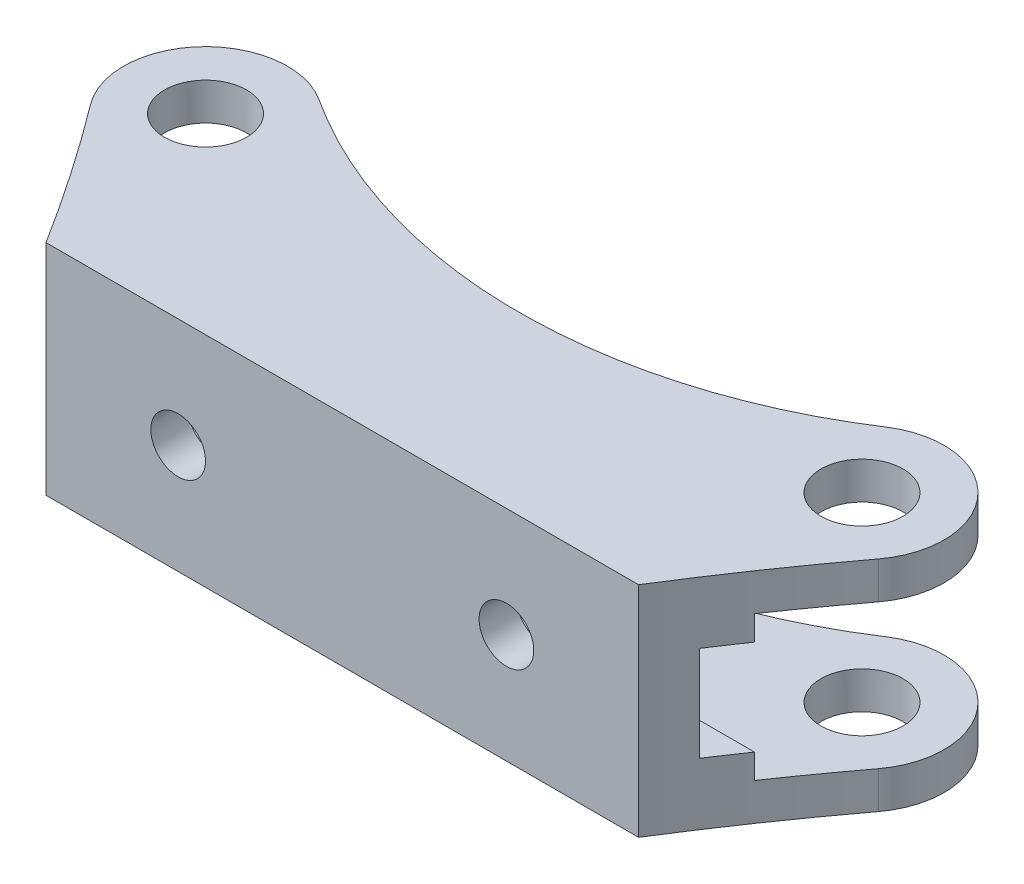
ISO-10303-21;
HEADER;
FILE_DESCRIPTION(('STEP AP214'),'2;1');
FILE_NAME('part.step','',(''),(''),'','','');
FILE_SCHEMA(('AUTOMOTIVE_DESIGN { 1 0 10303 214 1 1 1 1 }'));
ENDSEC;
DATA;
#1=APPLICATION_CONTEXT('core data for automotive mechanical design processes');
#2=APPLICATION_PROTOCOL_DEFINITION('international standard','automotive_design',2000,#1);
#3=PRODUCT_CONTEXT('',#1,'mechanical');
#4=PRODUCT('Part','Part','',(#3));
#5=PRODUCT_RELATED_PRODUCT_CATEGORY('part','',(#4));
#6=PRODUCT_DEFINITION_FORMATION('','',#4);
#7=PRODUCT_DEFINITION_CONTEXT('part definition',#1,'design');
#8=PRODUCT_DEFINITION('design','',#6,#7);
#9=PRODUCT_DEFINITION_SHAPE('','',#8);
#10=(LENGTH_UNIT() NAMED_UNIT(*) SI_UNIT(.MILLI.,.METRE.));
#11=(NAMED_UNIT(*) PLANE_ANGLE_UNIT() SI_UNIT($,.RADIAN.));
#12=(NAMED_UNIT(*) SI_UNIT($,.STERADIAN.) SOLID_ANGLE_UNIT());
#13=UNCERTAINTY_MEASURE_WITH_UNIT(LENGTH_MEASURE(1.E-05),#10,'distance_accuracy_value','');
#14=(GEOMETRIC_REPRESENTATION_CONTEXT(3) GLOBAL_UNCERTAINTY_ASSIGNED_CONTEXT((#13)) GLOBAL_UNIT_ASSIGNED_CONTEXT((#10,
#11,#12)) REPRESENTATION_CONTEXT('',''));
#15=CARTESIAN_POINT('',(0.,0.,0.));
#16=DIRECTION('',(0.,0.,1.));
#17=DIRECTION('',(1.,0.,0.));
#18=AXIS2_PLACEMENT_3D('',#15,#16,#17);
#19=CARTESIAN_POINT('',(47.625,-8.382,-4.318));
#20=DIRECTION('',(0.,0.,1.));
#21=DIRECTION('',(1.,0.,0.));
#22=AXIS2_PLACEMENT_3D('',#19,#20,#21);
#23=PLANE('',#22);
#24=CARTESIAN_POINT('',(19.05,0.,-4.318));
#25=DIRECTION('',(0.,0.,-1.));
#26=DIRECTION('',(1.,0.,0.));
#27=AXIS2_PLACEMENT_3D('',#24,#25,#26);
#28=CIRCLE('',#27,3.175);
#29=CARTESIAN_POINT('',(22.225,0.,-4.318));
#30=VERTEX_POINT('',#29);
#31=EDGE_CURVE('E252',#30,#30,#28,.T.);
#32=ORIENTED_EDGE('',*,*,#31,.F.);
#33=EDGE_LOOP('',(#32));
#34=FACE_BOUND('',#33,.T.);
#35=CARTESIAN_POINT('',(-19.05,0.,-4.318));
#36=DIRECTION('',(0.,0.,-1.));
#37=DIRECTION('',(-1.,0.,0.));
#38=AXIS2_PLACEMENT_3D('',#35,#36,#37);
#39=CIRCLE('',#38,3.175);
#40=CARTESIAN_POINT('',(-22.225,0.,-4.318));
#41=VERTEX_POINT('',#40);
#42=EDGE_CURVE('E256',#41,#41,#39,.T.);
#43=ORIENTED_EDGE('',*,*,#42,.F.);
#44=EDGE_LOOP('',(#43));
#45=FACE_BOUND('',#44,.T.);
#46=DIRECTION('',(-1.,0.,0.));
#47=VECTOR('',#46,1.);
#48=CARTESIAN_POINT('',(52.3875,5.5245,-4.318));
#49=LINE('',#48,#47);
#50=CARTESIAN_POINT('',(37.1595016436992,5.5245,-4.31799999999999));
#51=VERTEX_POINT('',#50);
#52=CARTESIAN_POINT('',(-37.1595016436991,5.5245,-4.31799999999999));
#53=VERTEX_POINT('',#52);
#54=EDGE_CURVE('E246',#51,#53,#49,.T.);
#55=ORIENTED_EDGE('',*,*,#54,.F.);
#56=DIRECTION('',(0.,1.,0.));
#57=VECTOR('',#56,1.);
#58=CARTESIAN_POINT('',(37.1595016436992,-12.7,-4.31799999999999));
#59=LINE('',#58,#57);
#60=CARTESIAN_POINT('',(37.1595016436992,-5.5245,-4.31799999999993));
#61=VERTEX_POINT('',#60);
#62=EDGE_CURVE('E201',#51,#61,#59,.F.);
#63=ORIENTED_EDGE('',*,*,#62,.T.);
#64=DIRECTION('',(-1.,0.,0.));
#65=VECTOR('',#64,1.);
#66=CARTESIAN_POINT('',(52.3875,-5.5245,-4.318));
#67=LINE('',#66,#65);
#68=CARTESIAN_POINT('',(-37.1595016436992,-5.5245,-4.31799999999993));
#69=VERTEX_POINT('',#68);
#70=EDGE_CURVE('E57',#61,#69,#67,.T.);
#71=ORIENTED_EDGE('',*,*,#70,.T.);
#72=DIRECTION('',(0.,1.,0.));
#73=VECTOR('',#72,1.);
#74=CARTESIAN_POINT('',(-37.1595016436991,-12.7,-4.31799999999999));
#75=LINE('',#74,#73);
#76=EDGE_CURVE('E230',#69,#53,#75,.T.);
#77=ORIENTED_EDGE('',*,*,#76,.T.);
#78=EDGE_LOOP('',(#55,#63,#71,#77));
#79=FACE_BOUND('',#78,.T.);
#80=ADVANCED_FACE('F35',(#34,#45,#79),#23,.F.);
#81=CARTESIAN_POINT('',(47.625,-8.382,-4.318));
#82=DIRECTION('',(0.,-1.,0.));
#83=DIRECTION('',(0.,0.,-1.));
#84=AXIS2_PLACEMENT_3D('',#81,#82,#83);
#85=PLANE('',#84);
#86=CARTESIAN_POINT('',(38.1,-8.382,-22.225));
#87=DIRECTION('',(0.,-1.,0.));
#88=DIRECTION('',(0.,0.,-1.));
#89=AXIS2_PLACEMENT_3D('',#86,#87,#88);
#90=CIRCLE('',#89,4.7625);
#91=CARTESIAN_POINT('',(38.1,-8.382,-26.9875));
#92=VERTEX_POINT('',#91);
#93=EDGE_CURVE('E280',#92,#92,#90,.T.);
#94=ORIENTED_EDGE('',*,*,#93,.T.);
#95=EDGE_LOOP('',(#94));
#96=FACE_BOUND('',#95,.T.);
#97=CARTESIAN_POINT('',(-38.1,-8.382,-22.225));
#98=DIRECTION('',(0.,-1.,0.));
#99=DIRECTION('',(0.,0.,-1.));
#100=AXIS2_PLACEMENT_3D('',#97,#98,#99);
#101=CIRCLE('',#100,4.7625);
#102=CARTESIAN_POINT('',(-38.1,-8.382,-26.9875));
#103=VERTEX_POINT('',#102);
#104=EDGE_CURVE('E270',#103,#103,#101,.T.);
#105=ORIENTED_EDGE('',*,*,#104,.T.);
#106=EDGE_LOOP('',(#105));
#107=FACE_BOUND('',#106,.T.);
#108=CARTESIAN_POINT('',(0.,-8.382,-80.7691073038098));
#109=DIRECTION('',(0.,-1.,0.));
#110=DIRECTION('',(0.,0.,-1.));
#111=AXIS2_PLACEMENT_3D('',#108,#109,#110);
#112=CIRCLE('',#111,60.325);
#113=CARTESIAN_POINT('',(32.9045454545455,-8.382,-30.2082873596104));
#114=VERTEX_POINT('',#113);
#115=CARTESIAN_POINT('',(-32.9045454545455,-8.382,-30.2082873596104));
#116=VERTEX_POINT('',#115);
#117=EDGE_CURVE('E169',#114,#116,#112,.T.);
#118=ORIENTED_EDGE('',*,*,#117,.T.);
#119=CARTESIAN_POINT('',(-38.1,-8.382,-22.225));
#120=DIRECTION('',(0.,-1.,0.));
#121=DIRECTION('',(0.,0.,-1.));
#122=AXIS2_PLACEMENT_3D('',#119,#120,#121);
#123=CIRCLE('',#122,9.525);
#124=CARTESIAN_POINT('',(-45.72,-8.382,-16.51));
#125=VERTEX_POINT('',#124);
#126=EDGE_CURVE('E288',#116,#125,#123,.F.);
#127=ORIENTED_EDGE('',*,*,#126,.T.);
#128=CARTESIAN_POINT('',(-235.88826987955,-8.382,126.11620240966));
#129=DIRECTION('',(0.,-1.,0.));
#130=DIRECTION('',(0.,0.,-1.));
#131=AXIS2_PLACEMENT_3D('',#128,#129,#130);
#132=CIRCLE('',#131,237.710337349436);
#133=CARTESIAN_POINT('',(-39.7130966231542,-8.382,-8.128));
#134=VERTEX_POINT('',#133);
#135=EDGE_CURVE('E227',#125,#134,#132,.T.);
#136=ORIENTED_EDGE('',*,*,#135,.T.);
#137=DIRECTION('',(-1.,0.,0.));
#138=VECTOR('',#137,1.);
#139=CARTESIAN_POINT('',(52.3875,-8.382,-8.128));
#140=LINE('',#139,#138);
#141=CARTESIAN_POINT('',(39.7130966231543,-8.382,-8.128));
#142=VERTEX_POINT('',#141);
#143=EDGE_CURVE('E241',#142,#134,#140,.T.);
#144=ORIENTED_EDGE('',*,*,#143,.F.);
#145=CARTESIAN_POINT('',(235.88826987955,-8.382,126.11620240966));
#146=DIRECTION('',(0.,-1.,0.));
#147=DIRECTION('',(0.,0.,-1.));
#148=AXIS2_PLACEMENT_3D('',#145,#146,#147);
#149=CIRCLE('',#148,237.710337349436);
#150=CARTESIAN_POINT('',(45.72,-8.382,-16.51));
#151=VERTEX_POINT('',#150);
#152=EDGE_CURVE('E198',#142,#151,#149,.T.);
#153=ORIENTED_EDGE('',*,*,#152,.T.);
#154=CARTESIAN_POINT('',(38.1,-8.382,-22.225));
#155=DIRECTION('',(0.,-1.,0.));
#156=DIRECTION('',(0.,0.,-1.));
#157=AXIS2_PLACEMENT_3D('',#154,#155,#156);
#158=CIRCLE('',#157,9.525);
#159=EDGE_CURVE('E294',#151,#114,#158,.F.);
#160=ORIENTED_EDGE('',*,*,#159,.T.);
#161=EDGE_LOOP('',(#118,#127,#136,#144,#153,#160));
#162=FACE_BOUND('',#161,.T.);
#163=ADVANCED_FACE('F318',(#96,#107,#162),#85,.F.);
#164=CARTESIAN_POINT('',(47.625,8.382,-4.318));
#165=DIRECTION('',(0.,1.,0.));
#166=DIRECTION('',(0.,0.,1.));
#167=AXIS2_PLACEMENT_3D('',#164,#165,#166);
#168=PLANE('',#167);
#169=CARTESIAN_POINT('',(38.1,8.382,-22.225));
#170=DIRECTION('',(0.,1.,0.));
#171=DIRECTION('',(0.,0.,1.));
#172=AXIS2_PLACEMENT_3D('',#169,#170,#171);
#173=CIRCLE('',#172,4.7625);
#174=CARTESIAN_POINT('',(38.1,8.382,-17.4625));
#175=VERTEX_POINT('',#174);
#176=EDGE_CURVE('E281',#175,#175,#173,.T.);
#177=ORIENTED_EDGE('',*,*,#176,.T.);
#178=EDGE_LOOP('',(#177));
#179=FACE_BOUND('',#178,.T.);
#180=CARTESIAN_POINT('',(-38.1,8.382,-22.225));
#181=DIRECTION('',(0.,1.,0.));
#182=DIRECTION('',(0.,0.,1.));
#183=AXIS2_PLACEMENT_3D('',#180,#181,#182);
#184=CIRCLE('',#183,4.7625);
#185=CARTESIAN_POINT('',(-38.1,8.382,-17.4625));
#186=VERTEX_POINT('',#185);
#187=EDGE_CURVE('E271',#186,#186,#184,.T.);
#188=ORIENTED_EDGE('',*,*,#187,.T.);
#189=EDGE_LOOP('',(#188));
#190=FACE_BOUND('',#189,.T.);
#191=CARTESIAN_POINT('',(-38.1,8.382,-22.225));
#192=DIRECTION('',(0.,1.,0.));
#193=DIRECTION('',(0.,0.,1.));
#194=AXIS2_PLACEMENT_3D('',#191,#192,#193);
#195=CIRCLE('',#194,9.525);
#196=CARTESIAN_POINT('',(-45.72,8.382,-16.51));
#197=VERTEX_POINT('',#196);
#198=CARTESIAN_POINT('',(-32.9045454545455,8.382,-30.2082873596104));
#199=VERTEX_POINT('',#198);
#200=EDGE_CURVE('E302',#197,#199,#195,.F.);
#201=ORIENTED_EDGE('',*,*,#200,.T.);
#202=CARTESIAN_POINT('',(0.,8.382,-80.7691073038098));
#203=DIRECTION('',(0.,1.,0.));
#204=DIRECTION('',(0.,0.,1.));
#205=AXIS2_PLACEMENT_3D('',#202,#203,#204);
#206=CIRCLE('',#205,60.325);
#207=CARTESIAN_POINT('',(32.9045454545455,8.382,-30.2082873596104));
#208=VERTEX_POINT('',#207);
#209=EDGE_CURVE('E183',#199,#208,#206,.T.);
#210=ORIENTED_EDGE('',*,*,#209,.T.);
#211=CARTESIAN_POINT('',(38.1,8.382,-22.225));
#212=DIRECTION('',(0.,1.,0.));
#213=DIRECTION('',(0.,0.,1.));
#214=AXIS2_PLACEMENT_3D('',#211,#212,#213);
#215=CIRCLE('',#214,9.525);
#216=CARTESIAN_POINT('',(45.72,8.382,-16.51));
#217=VERTEX_POINT('',#216);
#218=EDGE_CURVE('E300',#208,#217,#215,.F.);
#219=ORIENTED_EDGE('',*,*,#218,.T.);
#220=CARTESIAN_POINT('',(235.88826987955,8.382,126.11620240966));
#221=DIRECTION('',(0.,1.,0.));
#222=DIRECTION('',(0.,0.,1.));
#223=AXIS2_PLACEMENT_3D('',#220,#221,#222);
#224=CIRCLE('',#223,237.710337349436);
#225=CARTESIAN_POINT('',(39.7130966231543,8.382,-8.128));
#226=VERTEX_POINT('',#225);
#227=EDGE_CURVE('E209',#217,#226,#224,.T.);
#228=ORIENTED_EDGE('',*,*,#227,.T.);
#229=DIRECTION('',(-1.,0.,0.));
#230=VECTOR('',#229,1.);
#231=CARTESIAN_POINT('',(52.3875,8.382,-8.128));
#232=LINE('',#231,#230);
#233=CARTESIAN_POINT('',(-39.7130966231542,8.382,-8.128));
#234=VERTEX_POINT('',#233);
#235=EDGE_CURVE('E250',#226,#234,#232,.T.);
#236=ORIENTED_EDGE('',*,*,#235,.T.);
#237=CARTESIAN_POINT('',(-235.88826987955,8.382,126.11620240966));
#238=DIRECTION('',(0.,1.,0.));
#239=DIRECTION('',(0.,0.,1.));
#240=AXIS2_PLACEMENT_3D('',#237,#238,#239);
#241=CIRCLE('',#240,237.710337349436);
#242=EDGE_CURVE('E238',#234,#197,#241,.T.);
#243=ORIENTED_EDGE('',*,*,#242,.T.);
#244=EDGE_LOOP('',(#201,#210,#219,#228,#236,#243));
#245=FACE_BOUND('',#244,.T.);
#246=ADVANCED_FACE('F343',(#179,#190,#245),#168,.F.);
#247=CARTESIAN_POINT('',(47.625,12.7,-31.75));
#248=DIRECTION('',(0.,-1.,0.));
#249=DIRECTION('',(0.,0.,-1.));
#250=AXIS2_PLACEMENT_3D('',#247,#248,#249);
#251=PLANE('',#250);
#252=CARTESIAN_POINT('',(-38.1,12.7,-22.225));
#253=DIRECTION('',(0.,1.,0.));
#254=DIRECTION('',(0.,0.,-1.));
#255=AXIS2_PLACEMENT_3D('',#252,#253,#254);
#256=CIRCLE('',#255,4.7625);
#257=CARTESIAN_POINT('',(-38.1,12.7,-26.9875));
#258=VERTEX_POINT('',#257);
#259=EDGE_CURVE('E262',#258,#258,#256,.T.);
#260=ORIENTED_EDGE('',*,*,#259,.F.);
#261=EDGE_LOOP('',(#260));
#262=FACE_BOUND('',#261,.T.);
#263=CARTESIAN_POINT('',(38.1,12.7,-22.225));
#264=DIRECTION('',(0.,1.,0.));
#265=DIRECTION('',(0.,0.,1.));
#266=AXIS2_PLACEMENT_3D('',#263,#264,#265);
#267=CIRCLE('',#266,4.7625);
#268=CARTESIAN_POINT('',(38.1,12.7,-17.4625));
#269=VERTEX_POINT('',#268);
#270=EDGE_CURVE('E274',#269,#269,#267,.T.);
#271=ORIENTED_EDGE('',*,*,#270,.F.);
#272=EDGE_LOOP('',(#271));
#273=FACE_BOUND('',#272,.T.);
#274=CARTESIAN_POINT('',(0.,12.7,-80.7691073038098));
#275=DIRECTION('',(0.,1.,0.));
#276=DIRECTION('',(0.,0.,1.));
#277=AXIS2_PLACEMENT_3D('',#274,#275,#276);
#278=CIRCLE('',#277,60.325);
#279=CARTESIAN_POINT('',(-32.9045454545455,12.7,-30.2082873596104));
#280=VERTEX_POINT('',#279);
#281=CARTESIAN_POINT('',(32.9045454545455,12.7,-30.2082873596104));
#282=VERTEX_POINT('',#281);
#283=EDGE_CURVE('E176',#280,#282,#278,.T.);
#284=ORIENTED_EDGE('',*,*,#283,.F.);
#285=CARTESIAN_POINT('',(-38.1,12.7,-22.225));
#286=DIRECTION('',(0.,-1.,0.));
#287=DIRECTION('',(0.,0.,-1.));
#288=AXIS2_PLACEMENT_3D('',#285,#286,#287);
#289=CIRCLE('',#288,9.525);
#290=CARTESIAN_POINT('',(-45.72,12.7,-16.51));
#291=VERTEX_POINT('',#290);
#292=EDGE_CURVE('E298',#280,#291,#289,.F.);
#293=ORIENTED_EDGE('',*,*,#292,.T.);
#294=CARTESIAN_POINT('',(-235.88826987955,12.7,126.11620240966));
#295=DIRECTION('',(0.,1.,0.));
#296=DIRECTION('',(0.,0.,1.));
#297=AXIS2_PLACEMENT_3D('',#294,#295,#296);
#298=CIRCLE('',#297,237.710337349436);
#299=CARTESIAN_POINT('',(-34.3916,12.7,0.));
#300=VERTEX_POINT('',#299);
#301=EDGE_CURVE('E212',#300,#291,#298,.T.);
#302=ORIENTED_EDGE('',*,*,#301,.F.);
#303=DIRECTION('',(-1.,0.,0.));
#304=VECTOR('',#303,1.);
#305=CARTESIAN_POINT('',(47.625,12.7,0.));
#306=LINE('',#305,#304);
#307=CARTESIAN_POINT('',(34.3916,12.7,0.));
#308=VERTEX_POINT('',#307);
#309=EDGE_CURVE('E286',#308,#300,#306,.T.);
#310=ORIENTED_EDGE('',*,*,#309,.F.);
#311=CARTESIAN_POINT('',(235.88826987955,12.7,126.11620240966));
#312=DIRECTION('',(0.,1.,0.));
#313=DIRECTION('',(0.,0.,-1.));
#314=AXIS2_PLACEMENT_3D('',#311,#312,#313);
#315=CIRCLE('',#314,237.710337349436);
#316=CARTESIAN_POINT('',(45.72,12.7,-16.51));
#317=VERTEX_POINT('',#316);
#318=EDGE_CURVE('E188',#317,#308,#315,.T.);
#319=ORIENTED_EDGE('',*,*,#318,.F.);
#320=CARTESIAN_POINT('',(38.1,12.7,-22.225));
#321=DIRECTION('',(0.,-1.,0.));
#322=DIRECTION('',(0.,0.,-1.));
#323=AXIS2_PLACEMENT_3D('',#320,#321,#322);
#324=CIRCLE('',#323,9.525);
#325=EDGE_CURVE('E159',#317,#282,#324,.F.);
#326=ORIENTED_EDGE('',*,*,#325,.T.);
#327=EDGE_LOOP('',(#284,#293,#302,#310,#319,#326));
#328=FACE_BOUND('',#327,.T.);
#329=ADVANCED_FACE('F334',(#262,#273,#328),#251,.F.);
#330=CARTESIAN_POINT('',(47.625,12.7,0.));
#331=DIRECTION('',(0.,0.,-1.));
#332=DIRECTION('',(-1.,0.,0.));
#333=AXIS2_PLACEMENT_3D('',#330,#331,#332);
#334=PLANE('',#333);
#335=CARTESIAN_POINT('',(19.05,0.,0.));
#336=DIRECTION('',(0.,0.,-1.));
#337=DIRECTION('',(1.,0.,0.));
#338=AXIS2_PLACEMENT_3D('',#335,#336,#337);
#339=CIRCLE('',#338,3.175);
#340=CARTESIAN_POINT('',(22.225,0.,0.));
#341=VERTEX_POINT('',#340);
#342=EDGE_CURVE('E253',#341,#341,#339,.T.);
#343=ORIENTED_EDGE('',*,*,#342,.T.);
#344=EDGE_LOOP('',(#343));
#345=FACE_BOUND('',#344,.T.);
#346=CARTESIAN_POINT('',(-19.05,0.,0.));
#347=DIRECTION('',(0.,0.,-1.));
#348=DIRECTION('',(-1.,0.,0.));
#349=AXIS2_PLACEMENT_3D('',#346,#347,#348);
#350=CIRCLE('',#349,3.175);
#351=CARTESIAN_POINT('',(-22.225,0.,0.));
#352=VERTEX_POINT('',#351);
#353=EDGE_CURVE('E259',#352,#352,#350,.T.);
#354=ORIENTED_EDGE('',*,*,#353,.T.);
#355=EDGE_LOOP('',(#354));
#356=FACE_BOUND('',#355,.T.);
#357=DIRECTION('',(-1.,0.,0.));
#358=VECTOR('',#357,1.);
#359=CARTESIAN_POINT('',(47.625,-12.7,0.));
#360=LINE('',#359,#358);
#361=CARTESIAN_POINT('',(34.3916,-12.7,0.));
#362=VERTEX_POINT('',#361);
#363=CARTESIAN_POINT('',(-34.3916,-12.7,0.));
#364=VERTEX_POINT('',#363);
#365=EDGE_CURVE('E284',#362,#364,#360,.T.);
#366=ORIENTED_EDGE('',*,*,#365,.F.);
#367=DIRECTION('',(0.,1.,0.));
#368=VECTOR('',#367,1.);
#369=CARTESIAN_POINT('',(34.3916,-12.7,0.));
#370=LINE('',#369,#368);
#371=EDGE_CURVE('E193',#362,#308,#370,.T.);
#372=ORIENTED_EDGE('',*,*,#371,.T.);
#373=ORIENTED_EDGE('',*,*,#309,.T.);
#374=DIRECTION('',(0.,1.,0.));
#375=VECTOR('',#374,1.);
#376=CARTESIAN_POINT('',(-34.3916,-12.7,0.));
#377=LINE('',#376,#375);
#378=EDGE_CURVE('E218',#364,#300,#377,.T.);
#379=ORIENTED_EDGE('',*,*,#378,.F.);
#380=EDGE_LOOP('',(#366,#372,#373,#379));
#381=FACE_BOUND('',#380,.T.);
#382=ADVANCED_FACE('F328',(#345,#356,#381),#334,.F.);
#383=CARTESIAN_POINT('',(47.625,-12.7,-31.75));
#384=DIRECTION('',(0.,1.,0.));
#385=DIRECTION('',(0.,0.,1.));
#386=AXIS2_PLACEMENT_3D('',#383,#384,#385);
#387=PLANE('',#386);
#388=CARTESIAN_POINT('',(-38.1,-12.7,-22.225));
#389=DIRECTION('',(0.,1.,0.));
#390=DIRECTION('',(0.,0.,-1.));
#391=AXIS2_PLACEMENT_3D('',#388,#389,#390);
#392=CIRCLE('',#391,4.7625);
#393=CARTESIAN_POINT('',(-38.1,-12.7,-26.9875));
#394=VERTEX_POINT('',#393);
#395=EDGE_CURVE('E267',#394,#394,#392,.T.);
#396=ORIENTED_EDGE('',*,*,#395,.T.);
#397=EDGE_LOOP('',(#396));
#398=FACE_BOUND('',#397,.T.);
#399=CARTESIAN_POINT('',(38.1,-12.7,-22.225));
#400=DIRECTION('',(0.,1.,0.));
#401=DIRECTION('',(0.,0.,1.));
#402=AXIS2_PLACEMENT_3D('',#399,#400,#401);
#403=CIRCLE('',#402,4.7625);
#404=CARTESIAN_POINT('',(38.1,-12.7,-17.4625));
#405=VERTEX_POINT('',#404);
#406=EDGE_CURVE('E277',#405,#405,#403,.T.);
#407=ORIENTED_EDGE('',*,*,#406,.T.);
#408=EDGE_LOOP('',(#407));
#409=FACE_BOUND('',#408,.T.);
#410=CARTESIAN_POINT('',(-38.1,-12.7,-22.225));
#411=DIRECTION('',(0.,1.,0.));
#412=DIRECTION('',(0.,0.,1.));
#413=AXIS2_PLACEMENT_3D('',#410,#411,#412);
#414=CIRCLE('',#413,9.525);
#415=CARTESIAN_POINT('',(-45.72,-12.7,-16.51));
#416=VERTEX_POINT('',#415);
#417=CARTESIAN_POINT('',(-32.9045454545455,-12.7,-30.2082873596104));
#418=VERTEX_POINT('',#417);
#419=EDGE_CURVE('E160',#416,#418,#414,.F.);
#420=ORIENTED_EDGE('',*,*,#419,.T.);
#421=CARTESIAN_POINT('',(0.,-12.7,-80.7691073038098));
#422=DIRECTION('',(0.,1.,0.));
#423=DIRECTION('',(0.,0.,1.));
#424=AXIS2_PLACEMENT_3D('',#421,#422,#423);
#425=CIRCLE('',#424,60.325);
#426=CARTESIAN_POINT('',(32.9045454545455,-12.7,-30.2082873596104));
#427=VERTEX_POINT('',#426);
#428=EDGE_CURVE('E167',#418,#427,#425,.T.);
#429=ORIENTED_EDGE('',*,*,#428,.T.);
#430=CARTESIAN_POINT('',(38.1,-12.7,-22.225));
#431=DIRECTION('',(0.,1.,0.));
#432=DIRECTION('',(0.,0.,1.));
#433=AXIS2_PLACEMENT_3D('',#430,#431,#432);
#434=CIRCLE('',#433,9.525);
#435=CARTESIAN_POINT('',(45.72,-12.7,-16.51));
#436=VERTEX_POINT('',#435);
#437=EDGE_CURVE('E149',#427,#436,#434,.F.);
#438=ORIENTED_EDGE('',*,*,#437,.T.);
#439=CARTESIAN_POINT('',(235.88826987955,-12.7,126.11620240966));
#440=DIRECTION('',(0.,1.,0.));
#441=DIRECTION('',(0.,0.,-1.));
#442=AXIS2_PLACEMENT_3D('',#439,#440,#441);
#443=CIRCLE('',#442,237.710337349436);
#444=EDGE_CURVE('E189',#436,#362,#443,.T.);
#445=ORIENTED_EDGE('',*,*,#444,.T.);
#446=ORIENTED_EDGE('',*,*,#365,.T.);
#447=CARTESIAN_POINT('',(-235.88826987955,-12.7,126.11620240966));
#448=DIRECTION('',(0.,1.,0.));
#449=DIRECTION('',(0.,0.,1.));
#450=AXIS2_PLACEMENT_3D('',#447,#448,#449);
#451=CIRCLE('',#450,237.710337349436);
#452=EDGE_CURVE('E213',#364,#416,#451,.T.);
#453=ORIENTED_EDGE('',*,*,#452,.T.);
#454=EDGE_LOOP('',(#420,#429,#438,#445,#446,#453));
#455=FACE_BOUND('',#454,.T.);
#456=ADVANCED_FACE('F173',(#398,#409,#455),#387,.F.);
#457=CARTESIAN_POINT('',(38.1,-12.7,-22.225));
#458=DIRECTION('',(0.,1.,0.));
#459=DIRECTION('',(0.,0.,1.));
#460=AXIS2_PLACEMENT_3D('',#457,#458,#459);
#461=CYLINDRICAL_SURFACE('',#460,4.7625);
#462=ORIENTED_EDGE('',*,*,#406,.F.);
#463=EDGE_LOOP('',(#462));
#464=FACE_BOUND('',#463,.T.);
#465=ORIENTED_EDGE('',*,*,#93,.F.);
#466=EDGE_LOOP('',(#465));
#467=FACE_BOUND('',#466,.T.);
#468=ADVANCED_FACE('F381',(#464,#467),#461,.F.);
#469=ORIENTED_EDGE('',*,*,#270,.T.);
#470=EDGE_LOOP('',(#469));
#471=FACE_BOUND('',#470,.T.);
#472=ORIENTED_EDGE('',*,*,#176,.F.);
#473=EDGE_LOOP('',(#472));
#474=FACE_BOUND('',#473,.T.);
#475=ADVANCED_FACE('F376',(#471,#474),#461,.F.);
#476=CARTESIAN_POINT('',(-38.1,-12.7,-22.225));
#477=DIRECTION('',(0.,1.,0.));
#478=DIRECTION('',(0.,0.,1.));
#479=AXIS2_PLACEMENT_3D('',#476,#477,#478);
#480=CYLINDRICAL_SURFACE('',#479,4.7625);
#481=ORIENTED_EDGE('',*,*,#395,.F.);
#482=EDGE_LOOP('',(#481));
#483=FACE_BOUND('',#482,.T.);
#484=ORIENTED_EDGE('',*,*,#104,.F.);
#485=EDGE_LOOP('',(#484));
#486=FACE_BOUND('',#485,.T.);
#487=ADVANCED_FACE('F416',(#483,#486),#480,.F.);
#488=ORIENTED_EDGE('',*,*,#259,.T.);
#489=EDGE_LOOP('',(#488));
#490=FACE_BOUND('',#489,.T.);
#491=ORIENTED_EDGE('',*,*,#187,.F.);
#492=EDGE_LOOP('',(#491));
#493=FACE_BOUND('',#492,.T.);
#494=ADVANCED_FACE('F394',(#490,#493),#480,.F.);
#495=CARTESIAN_POINT('',(38.1,8.382,-22.225));
#496=DIRECTION('',(0.,-1.,0.));
#497=DIRECTION('',(0.,0.,-1.));
#498=AXIS2_PLACEMENT_3D('',#495,#496,#497);
#499=CYLINDRICAL_SURFACE('',#498,9.525);
#500=ORIENTED_EDGE('',*,*,#437,.F.);
#501=DIRECTION('',(0.,1.,0.));
#502=VECTOR('',#501,1.);
#503=CARTESIAN_POINT('',(32.9045454545455,-12.7,-30.2082873596104));
#504=LINE('',#503,#502);
#505=EDGE_CURVE('E152',#427,#114,#504,.T.);
#506=ORIENTED_EDGE('',*,*,#505,.T.);
#507=ORIENTED_EDGE('',*,*,#159,.F.);
#508=DIRECTION('',(0.,1.,0.));
#509=VECTOR('',#508,1.);
#510=CARTESIAN_POINT('',(45.72,-12.7,-16.51));
#511=LINE('',#510,#509);
#512=EDGE_CURVE('E154',#436,#151,#511,.T.);
#513=ORIENTED_EDGE('',*,*,#512,.F.);
#514=EDGE_LOOP('',(#500,#506,#507,#513));
#515=FACE_BOUND('',#514,.T.);
#516=ADVANCED_FACE('F151',(#515),#499,.T.);
#517=CARTESIAN_POINT('',(-38.1,-8.382,-22.225));
#518=DIRECTION('',(0.,1.,0.));
#519=DIRECTION('',(0.,0.,1.));
#520=AXIS2_PLACEMENT_3D('',#517,#518,#519);
#521=CYLINDRICAL_SURFACE('',#520,9.525);
#522=ORIENTED_EDGE('',*,*,#419,.F.);
#523=DIRECTION('',(0.,1.,0.));
#524=VECTOR('',#523,1.);
#525=CARTESIAN_POINT('',(-45.72,-12.7,-16.51));
#526=LINE('',#525,#524);
#527=EDGE_CURVE('E222',#416,#125,#526,.T.);
#528=ORIENTED_EDGE('',*,*,#527,.T.);
#529=ORIENTED_EDGE('',*,*,#126,.F.);
#530=DIRECTION('',(0.,1.,0.));
#531=VECTOR('',#530,1.);
#532=CARTESIAN_POINT('',(-32.9045454545455,-12.7,-30.2082873596104));
#533=LINE('',#532,#531);
#534=EDGE_CURVE('E182',#418,#116,#533,.T.);
#535=ORIENTED_EDGE('',*,*,#534,.F.);
#536=EDGE_LOOP('',(#522,#528,#529,#535));
#537=FACE_BOUND('',#536,.T.);
#538=ADVANCED_FACE('F322',(#537),#521,.T.);
#539=CARTESIAN_POINT('',(-38.1,8.382,-22.225));
#540=DIRECTION('',(0.,1.,0.));
#541=DIRECTION('',(0.,0.,1.));
#542=AXIS2_PLACEMENT_3D('',#539,#540,#541);
#543=CYLINDRICAL_SURFACE('',#542,9.525);
#544=ORIENTED_EDGE('',*,*,#200,.F.);
#545=EDGE_CURVE('E215',#197,#291,#526,.T.);
#546=ORIENTED_EDGE('',*,*,#545,.T.);
#547=ORIENTED_EDGE('',*,*,#292,.F.);
#548=EDGE_CURVE('E170',#199,#280,#533,.T.);
#549=ORIENTED_EDGE('',*,*,#548,.F.);
#550=EDGE_LOOP('',(#544,#546,#547,#549));
#551=FACE_BOUND('',#550,.T.);
#552=ADVANCED_FACE('F340',(#551),#543,.T.);
#553=CARTESIAN_POINT('',(38.1,8.382,-22.225));
#554=DIRECTION('',(0.,-1.,0.));
#555=DIRECTION('',(0.,0.,-1.));
#556=AXIS2_PLACEMENT_3D('',#553,#554,#555);
#557=CYLINDRICAL_SURFACE('',#556,9.525);
#558=ORIENTED_EDGE('',*,*,#218,.F.);
#559=EDGE_CURVE('E171',#208,#282,#504,.T.);
#560=ORIENTED_EDGE('',*,*,#559,.T.);
#561=ORIENTED_EDGE('',*,*,#325,.F.);
#562=EDGE_CURVE('E191',#217,#317,#511,.T.);
#563=ORIENTED_EDGE('',*,*,#562,.F.);
#564=EDGE_LOOP('',(#558,#560,#561,#563));
#565=FACE_BOUND('',#564,.T.);
#566=ADVANCED_FACE('F37',(#565),#557,.T.);
#567=CARTESIAN_POINT('',(-19.05,0.,0.));
#568=DIRECTION('',(0.,0.,-1.));
#569=DIRECTION('',(-1.,0.,0.));
#570=AXIS2_PLACEMENT_3D('',#567,#568,#569);
#571=CYLINDRICAL_SURFACE('',#570,3.175);
#572=ORIENTED_EDGE('',*,*,#353,.F.);
#573=EDGE_LOOP('',(#572));
#574=FACE_BOUND('',#573,.T.);
#575=ORIENTED_EDGE('',*,*,#42,.T.);
#576=EDGE_LOOP('',(#575));
#577=FACE_BOUND('',#576,.T.);
#578=ADVANCED_FACE('F400',(#574,#577),#571,.F.);
#579=CARTESIAN_POINT('',(19.05,0.,0.));
#580=DIRECTION('',(0.,0.,-1.));
#581=DIRECTION('',(-1.,0.,0.));
#582=AXIS2_PLACEMENT_3D('',#579,#580,#581);
#583=CYLINDRICAL_SURFACE('',#582,3.175);
#584=ORIENTED_EDGE('',*,*,#342,.F.);
#585=EDGE_LOOP('',(#584));
#586=FACE_BOUND('',#585,.T.);
#587=ORIENTED_EDGE('',*,*,#31,.T.);
#588=EDGE_LOOP('',(#587));
#589=FACE_BOUND('',#588,.T.);
#590=ADVANCED_FACE('F404',(#586,#589),#583,.F.);
#591=CARTESIAN_POINT('',(52.3875,5.5245,-4.318));
#592=DIRECTION('',(0.,1.,0.));
#593=DIRECTION('',(0.,0.,1.));
#594=AXIS2_PLACEMENT_3D('',#591,#592,#593);
#595=PLANE('',#594);
#596=DIRECTION('',(-1.,0.,0.));
#597=VECTOR('',#596,1.);
#598=CARTESIAN_POINT('',(52.3875,5.5245,-8.128));
#599=LINE('',#598,#597);
#600=CARTESIAN_POINT('',(39.7130966231543,5.5245,-8.12799999999994));
#601=VERTEX_POINT('',#600);
#602=CARTESIAN_POINT('',(-39.7130966231542,5.5245,-8.12799999999994));
#603=VERTEX_POINT('',#602);
#604=EDGE_CURVE('E248',#601,#603,#599,.T.);
#605=ORIENTED_EDGE('',*,*,#604,.F.);
#606=CARTESIAN_POINT('',(235.88826987955,5.5245,126.11620240966));
#607=DIRECTION('',(0.,1.,0.));
#608=DIRECTION('',(0.,0.,1.));
#609=AXIS2_PLACEMENT_3D('',#606,#607,#608);
#610=CIRCLE('',#609,237.710337349436);
#611=EDGE_CURVE('E203',#601,#51,#610,.T.);
#612=ORIENTED_EDGE('',*,*,#611,.T.);
#613=ORIENTED_EDGE('',*,*,#54,.T.);
#614=CARTESIAN_POINT('',(-235.88826987955,5.5245,126.11620240966));
#615=DIRECTION('',(0.,1.,0.));
#616=DIRECTION('',(0.,0.,1.));
#617=AXIS2_PLACEMENT_3D('',#614,#615,#616);
#618=CIRCLE('',#617,237.710337349436);
#619=EDGE_CURVE('E232',#53,#603,#618,.T.);
#620=ORIENTED_EDGE('',*,*,#619,.T.);
#621=EDGE_LOOP('',(#605,#612,#613,#620));
#622=FACE_BOUND('',#621,.T.);
#623=ADVANCED_FACE('F351',(#622),#595,.F.);
#624=CARTESIAN_POINT('',(52.3875,8.382,-8.128));
#625=DIRECTION('',(0.,0.,1.));
#626=DIRECTION('',(1.,0.,0.));
#627=AXIS2_PLACEMENT_3D('',#624,#625,#626);
#628=PLANE('',#627);
#629=ORIENTED_EDGE('',*,*,#235,.F.);
#630=DIRECTION('',(0.,1.,0.));
#631=VECTOR('',#630,1.);
#632=CARTESIAN_POINT('',(39.7130966231543,-12.7,-8.128));
#633=LINE('',#632,#631);
#634=EDGE_CURVE('E206',#226,#601,#633,.F.);
#635=ORIENTED_EDGE('',*,*,#634,.T.);
#636=ORIENTED_EDGE('',*,*,#604,.T.);
#637=DIRECTION('',(0.,1.,0.));
#638=VECTOR('',#637,1.);
#639=CARTESIAN_POINT('',(-39.7130966231542,-12.7,-8.128));
#640=LINE('',#639,#638);
#641=EDGE_CURVE('E235',#603,#234,#640,.T.);
#642=ORIENTED_EDGE('',*,*,#641,.T.);
#643=EDGE_LOOP('',(#629,#635,#636,#642));
#644=FACE_BOUND('',#643,.T.);
#645=ADVANCED_FACE('F348',(#644),#628,.F.);
#646=CARTESIAN_POINT('',(52.3875,-8.382,-8.128));
#647=DIRECTION('',(0.,0.,1.));
#648=DIRECTION('',(1.,0.,0.));
#649=AXIS2_PLACEMENT_3D('',#646,#647,#648);
#650=PLANE('',#649);
#651=DIRECTION('',(-1.,0.,0.));
#652=VECTOR('',#651,1.);
#653=CARTESIAN_POINT('',(52.3875,-5.5245,-8.128));
#654=LINE('',#653,#652);
#655=CARTESIAN_POINT('',(39.7130966231543,-5.5245,-8.12799999999994));
#656=VERTEX_POINT('',#655);
#657=CARTESIAN_POINT('',(-39.7130966231542,-5.5245,-8.12799999999994));
#658=VERTEX_POINT('',#657);
#659=EDGE_CURVE('E243',#656,#658,#654,.T.);
#660=ORIENTED_EDGE('',*,*,#659,.F.);
#661=DIRECTION('',(0.,1.,0.));
#662=VECTOR('',#661,1.);
#663=CARTESIAN_POINT('',(39.7130966231543,-12.7,-8.128));
#664=LINE('',#663,#662);
#665=EDGE_CURVE('E50',#656,#142,#664,.F.);
#666=ORIENTED_EDGE('',*,*,#665,.T.);
#667=ORIENTED_EDGE('',*,*,#143,.T.);
#668=DIRECTION('',(0.,1.,0.));
#669=VECTOR('',#668,1.);
#670=CARTESIAN_POINT('',(-39.7130966231542,-12.7,-8.128));
#671=LINE('',#670,#669);
#672=EDGE_CURVE('E221',#134,#658,#671,.T.);
#673=ORIENTED_EDGE('',*,*,#672,.T.);
#674=EDGE_LOOP('',(#660,#666,#667,#673));
#675=FACE_BOUND('',#674,.T.);
#676=ADVANCED_FACE('F315',(#675),#650,.F.);
#677=CARTESIAN_POINT('',(52.3875,-5.5245,-4.318));
#678=DIRECTION('',(0.,-1.,0.));
#679=DIRECTION('',(0.,0.,-1.));
#680=AXIS2_PLACEMENT_3D('',#677,#678,#679);
#681=PLANE('',#680);
#682=ORIENTED_EDGE('',*,*,#70,.F.);
#683=CARTESIAN_POINT('',(235.88826987955,-5.5245,126.11620240966));
#684=DIRECTION('',(0.,-1.,0.));
#685=DIRECTION('',(0.,0.,-1.));
#686=AXIS2_PLACEMENT_3D('',#683,#684,#685);
#687=CIRCLE('',#686,237.710337349436);
#688=EDGE_CURVE('E12',#61,#656,#687,.T.);
#689=ORIENTED_EDGE('',*,*,#688,.T.);
#690=ORIENTED_EDGE('',*,*,#659,.T.);
#691=CARTESIAN_POINT('',(-235.88826987955,-5.5245,126.11620240966));
#692=DIRECTION('',(0.,-1.,0.));
#693=DIRECTION('',(0.,0.,-1.));
#694=AXIS2_PLACEMENT_3D('',#691,#692,#693);
#695=CIRCLE('',#694,237.710337349436);
#696=EDGE_CURVE('E43',#658,#69,#695,.T.);
#697=ORIENTED_EDGE('',*,*,#696,.T.);
#698=EDGE_LOOP('',(#682,#689,#690,#697));
#699=FACE_BOUND('',#698,.T.);
#700=ADVANCED_FACE('F306',(#699),#681,.F.);
#701=CARTESIAN_POINT('',(-235.88826987955,-12.7,126.11620240966));
#702=DIRECTION('',(0.,1.,0.));
#703=DIRECTION('',(0.,0.,1.));
#704=AXIS2_PLACEMENT_3D('',#701,#702,#703);
#705=CYLINDRICAL_SURFACE('',#704,237.710337349436);
#706=ORIENTED_EDGE('',*,*,#641,.F.);
#707=ORIENTED_EDGE('',*,*,#619,.F.);
#708=ORIENTED_EDGE('',*,*,#76,.F.);
#709=ORIENTED_EDGE('',*,*,#696,.F.);
#710=ORIENTED_EDGE('',*,*,#672,.F.);
#711=ORIENTED_EDGE('',*,*,#135,.F.);
#712=ORIENTED_EDGE('',*,*,#527,.F.);
#713=ORIENTED_EDGE('',*,*,#452,.F.);
#714=ORIENTED_EDGE('',*,*,#378,.T.);
#715=ORIENTED_EDGE('',*,*,#301,.T.);
#716=ORIENTED_EDGE('',*,*,#545,.F.);
#717=ORIENTED_EDGE('',*,*,#242,.F.);
#718=EDGE_LOOP('',(#706,#707,#708,#709,#710,#711,#712,#713,#714,#715,#716,#717));
#719=FACE_BOUND('',#718,.T.);
#720=ADVANCED_FACE('F311',(#719),#705,.F.);
#721=CARTESIAN_POINT('',(235.88826987955,-12.7,126.11620240966));
#722=DIRECTION('',(0.,1.,0.));
#723=DIRECTION('',(0.,0.,1.));
#724=AXIS2_PLACEMENT_3D('',#721,#722,#723);
#725=CYLINDRICAL_SURFACE('',#724,237.710337349436);
#726=ORIENTED_EDGE('',*,*,#562,.T.);
#727=ORIENTED_EDGE('',*,*,#318,.T.);
#728=ORIENTED_EDGE('',*,*,#371,.F.);
#729=ORIENTED_EDGE('',*,*,#444,.F.);
#730=ORIENTED_EDGE('',*,*,#512,.T.);
#731=ORIENTED_EDGE('',*,*,#152,.F.);
#732=ORIENTED_EDGE('',*,*,#665,.F.);
#733=ORIENTED_EDGE('',*,*,#688,.F.);
#734=ORIENTED_EDGE('',*,*,#62,.F.);
#735=ORIENTED_EDGE('',*,*,#611,.F.);
#736=ORIENTED_EDGE('',*,*,#634,.F.);
#737=ORIENTED_EDGE('',*,*,#227,.F.);
#738=EDGE_LOOP('',(#726,#727,#728,#729,#730,#731,#732,#733,#734,#735,#736,#737));
#739=FACE_BOUND('',#738,.T.);
#740=ADVANCED_FACE('F324',(#739),#725,.F.);
#741=CARTESIAN_POINT('',(0.,-12.7,-80.7691073038098));
#742=DIRECTION('',(0.,1.,0.));
#743=DIRECTION('',(0.,0.,1.));
#744=AXIS2_PLACEMENT_3D('',#741,#742,#743);
#745=CYLINDRICAL_SURFACE('',#744,60.325);
#746=ORIENTED_EDGE('',*,*,#548,.T.);
#747=ORIENTED_EDGE('',*,*,#283,.T.);
#748=ORIENTED_EDGE('',*,*,#559,.F.);
#749=ORIENTED_EDGE('',*,*,#209,.F.);
#750=EDGE_LOOP('',(#746,#747,#748,#749));
#751=FACE_BOUND('',#750,.T.);
#752=ADVANCED_FACE('F357',(#751),#745,.F.);
#753=ORIENTED_EDGE('',*,*,#505,.F.);
#754=ORIENTED_EDGE('',*,*,#428,.F.);
#755=ORIENTED_EDGE('',*,*,#534,.T.);
#756=ORIENTED_EDGE('',*,*,#117,.F.);
#757=EDGE_LOOP('',(#753,#754,#755,#756));
#758=FACE_BOUND('',#757,.T.);
#759=ADVANCED_FACE('F165',(#758),#745,.F.);
#760=CLOSED_SHELL('',(#80,#163,#246,#329,#382,#456,#468,#475,#487,#494,#516,#538,#552,#566,#578,
#590,#623,#645,#676,#700,#720,#740,#752,#759));
#761=MANIFOLD_SOLID_BREP('B2',#760);
#762=ADVANCED_BREP_SHAPE_REPRESENTATION('',(#18,#761),#14);
#763=SHAPE_DEFINITION_REPRESENTATION(#9,#762);
ENDSEC;
END-ISO-10303-21;
